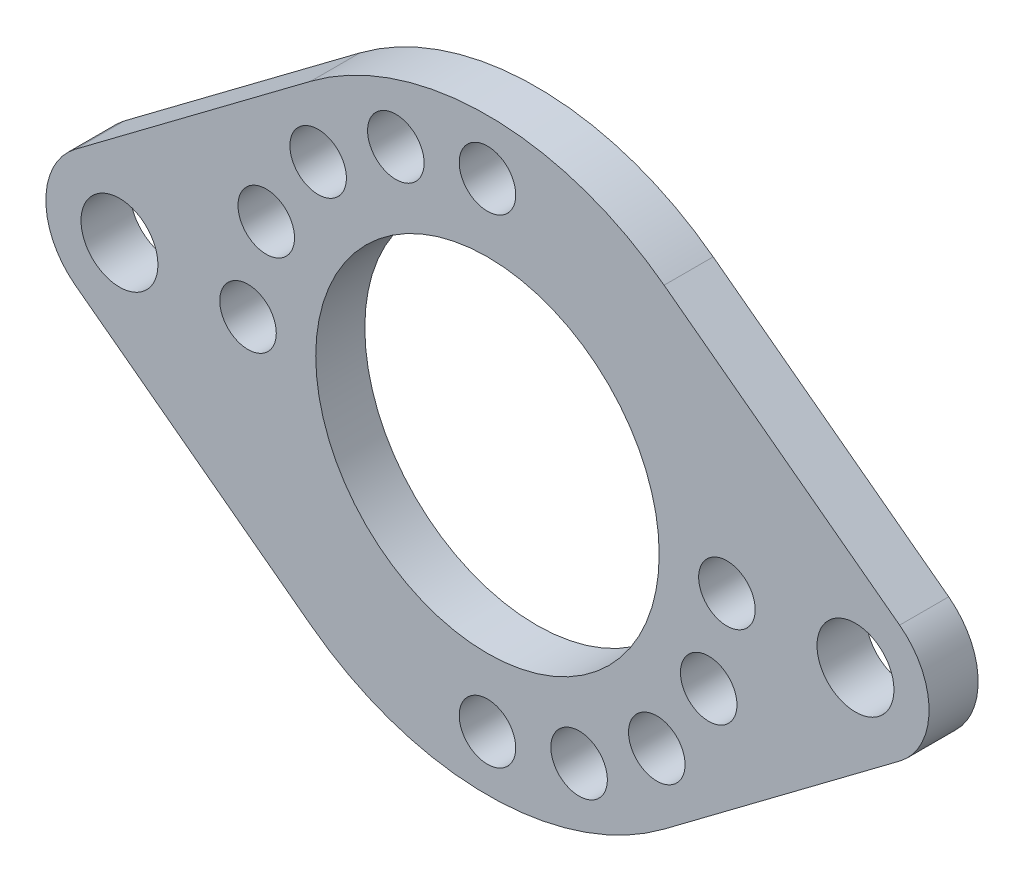
ISO-10303-21;
HEADER;
FILE_DESCRIPTION(('STEP AP214'),'2;1');
FILE_NAME('part.step','',(''),(''),'','','');
FILE_SCHEMA(('AUTOMOTIVE_DESIGN { 1 0 10303 214 1 1 1 1 }'));
ENDSEC;
DATA;
#1=APPLICATION_CONTEXT('core data for automotive mechanical design processes');
#2=APPLICATION_PROTOCOL_DEFINITION('international standard','automotive_design',2000,#1);
#3=PRODUCT_CONTEXT('',#1,'mechanical');
#4=PRODUCT('Part','Part','',(#3));
#5=PRODUCT_RELATED_PRODUCT_CATEGORY('part','',(#4));
#6=PRODUCT_DEFINITION_FORMATION('','',#4);
#7=PRODUCT_DEFINITION_CONTEXT('part definition',#1,'design');
#8=PRODUCT_DEFINITION('design','',#6,#7);
#9=PRODUCT_DEFINITION_SHAPE('','',#8);
#10=(LENGTH_UNIT() NAMED_UNIT(*) SI_UNIT(.MILLI.,.METRE.));
#11=(NAMED_UNIT(*) PLANE_ANGLE_UNIT() SI_UNIT($,.RADIAN.));
#12=(NAMED_UNIT(*) SI_UNIT($,.STERADIAN.) SOLID_ANGLE_UNIT());
#13=UNCERTAINTY_MEASURE_WITH_UNIT(LENGTH_MEASURE(1.E-05),#10,'distance_accuracy_value','');
#14=(GEOMETRIC_REPRESENTATION_CONTEXT(3) GLOBAL_UNCERTAINTY_ASSIGNED_CONTEXT((#13)) GLOBAL_UNIT_ASSIGNED_CONTEXT((#10,
#11,#12)) REPRESENTATION_CONTEXT('',''));
#15=CARTESIAN_POINT('',(0.,0.,0.));
#16=DIRECTION('',(0.,0.,1.));
#17=DIRECTION('',(1.,0.,0.));
#18=AXIS2_PLACEMENT_3D('',#15,#16,#17);
#19=CARTESIAN_POINT('',(0.,0.,-1.5875));
#20=DIRECTION('',(0.,0.,1.));
#21=DIRECTION('',(1.,0.,0.));
#22=AXIS2_PLACEMENT_3D('',#19,#20,#21);
#23=PLANE('',#22);
#24=CARTESIAN_POINT('',(0.,0.,-1.5875));
#25=DIRECTION('',(0.,0.,-1.));
#26=DIRECTION('',(-1.,0.,0.));
#27=AXIS2_PLACEMENT_3D('',#24,#25,#26);
#28=CIRCLE('',#27,11.1125);
#29=CARTESIAN_POINT('',(-11.1125,0.,-1.5875));
#30=VERTEX_POINT('',#29);
#31=EDGE_CURVE('E169',#30,#30,#28,.F.);
#32=ORIENTED_EDGE('',*,*,#31,.T.);
#33=EDGE_LOOP('',(#32));
#34=FACE_BOUND('',#33,.T.);
#35=CARTESIAN_POINT('',(-23.8125,0.,-1.5875));
#36=DIRECTION('',(0.,0.,-1.));
#37=DIRECTION('',(-1.,0.,0.));
#38=AXIS2_PLACEMENT_3D('',#35,#36,#37);
#39=CIRCLE('',#38,4.7625);
#40=CARTESIAN_POINT('',(-26.67,3.81,-1.5875));
#41=VERTEX_POINT('',#40);
#42=CARTESIAN_POINT('',(-26.67,-3.81,-1.5875));
#43=VERTEX_POINT('',#42);
#44=EDGE_CURVE('E173',#41,#43,#39,.F.);
#45=ORIENTED_EDGE('',*,*,#44,.F.);
#46=DIRECTION('',(-0.8,-0.6,0.));
#47=VECTOR('',#46,1.);
#48=CARTESIAN_POINT('',(-11.43,15.24,-1.5875));
#49=LINE('',#48,#47);
#50=CARTESIAN_POINT('',(-11.43,15.24,-1.5875));
#51=VERTEX_POINT('',#50);
#52=EDGE_CURVE('E112',#51,#41,#49,.T.);
#53=ORIENTED_EDGE('',*,*,#52,.F.);
#54=CARTESIAN_POINT('',(0.,0.,-1.5875));
#55=DIRECTION('',(0.,0.,-1.));
#56=DIRECTION('',(-1.,0.,0.));
#57=AXIS2_PLACEMENT_3D('',#54,#55,#56);
#58=CIRCLE('',#57,19.05);
#59=CARTESIAN_POINT('',(11.43,15.24,-1.5875));
#60=VERTEX_POINT('',#59);
#61=EDGE_CURVE('E117',#60,#51,#58,.F.);
#62=ORIENTED_EDGE('',*,*,#61,.F.);
#63=DIRECTION('',(0.8,-0.6,0.));
#64=VECTOR('',#63,1.);
#65=CARTESIAN_POINT('',(11.43,15.24,-1.5875));
#66=LINE('',#65,#64);
#67=CARTESIAN_POINT('',(26.67,3.81,-1.5875));
#68=VERTEX_POINT('',#67);
#69=EDGE_CURVE('E116',#60,#68,#66,.T.);
#70=ORIENTED_EDGE('',*,*,#69,.T.);
#71=CARTESIAN_POINT('',(23.8125,0.,-1.5875));
#72=DIRECTION('',(0.,0.,-1.));
#73=DIRECTION('',(-1.,0.,0.));
#74=AXIS2_PLACEMENT_3D('',#71,#72,#73);
#75=CIRCLE('',#74,4.7625);
#76=CARTESIAN_POINT('',(26.67,-3.81,-1.5875));
#77=VERTEX_POINT('',#76);
#78=EDGE_CURVE('E96',#77,#68,#75,.F.);
#79=ORIENTED_EDGE('',*,*,#78,.F.);
#80=DIRECTION('',(-0.8,-0.6,0.));
#81=VECTOR('',#80,1.);
#82=CARTESIAN_POINT('',(11.43,-15.24,-1.5875));
#83=LINE('',#82,#81);
#84=CARTESIAN_POINT('',(11.43,-15.24,-1.5875));
#85=VERTEX_POINT('',#84);
#86=EDGE_CURVE('E93',#77,#85,#83,.T.);
#87=ORIENTED_EDGE('',*,*,#86,.T.);
#88=CARTESIAN_POINT('',(0.,0.,-1.5875));
#89=DIRECTION('',(0.,0.,-1.));
#90=DIRECTION('',(-1.,0.,0.));
#91=AXIS2_PLACEMENT_3D('',#88,#89,#90);
#92=CIRCLE('',#91,19.05);
#93=CARTESIAN_POINT('',(-11.43,-15.24,-1.5875));
#94=VERTEX_POINT('',#93);
#95=EDGE_CURVE('E80',#94,#85,#92,.F.);
#96=ORIENTED_EDGE('',*,*,#95,.F.);
#97=DIRECTION('',(-0.8,0.6,0.));
#98=VECTOR('',#97,1.);
#99=CARTESIAN_POINT('',(-11.43,-15.24,-1.5875));
#100=LINE('',#99,#98);
#101=EDGE_CURVE('E90',#94,#43,#100,.T.);
#102=ORIENTED_EDGE('',*,*,#101,.T.);
#103=EDGE_LOOP('',(#45,#53,#62,#70,#79,#87,#96,#102));
#104=FACE_BOUND('',#103,.T.);
#105=CARTESIAN_POINT('',(0.,15.494,-1.5875));
#106=DIRECTION('',(0.,0.,1.));
#107=DIRECTION('',(1.,0.,0.));
#108=AXIS2_PLACEMENT_3D('',#105,#106,#107);
#109=CIRCLE('',#108,1.82879999999999);
#110=CARTESIAN_POINT('',(1.82879999999999,15.494,-1.5875));
#111=VERTEX_POINT('',#110);
#112=EDGE_CURVE('E111',#111,#111,#109,.T.);
#113=ORIENTED_EDGE('',*,*,#112,.T.);
#114=EDGE_LOOP('',(#113));
#115=FACE_BOUND('',#114,.T.);
#116=CARTESIAN_POINT('',(-15.494,0.,-1.5875));
#117=DIRECTION('',(0.,0.,1.));
#118=DIRECTION('',(1.,0.,0.));
#119=AXIS2_PLACEMENT_3D('',#116,#117,#118);
#120=CIRCLE('',#119,1.82879999999999);
#121=CARTESIAN_POINT('',(-13.6652,0.,-1.5875));
#122=VERTEX_POINT('',#121);
#123=EDGE_CURVE('E181',#122,#122,#120,.T.);
#124=ORIENTED_EDGE('',*,*,#123,.T.);
#125=EDGE_LOOP('',(#124));
#126=FACE_BOUND('',#125,.T.);
#127=CARTESIAN_POINT('',(-14.3145894767299,5.92929710106476,-1.5875));
#128=DIRECTION('',(0.,0.,1.));
#129=DIRECTION('',(1.,0.,0.));
#130=AXIS2_PLACEMENT_3D('',#127,#128,#129);
#131=CIRCLE('',#130,1.82879999999999);
#132=CARTESIAN_POINT('',(-12.4857894767299,5.92929710106476,-1.5875));
#133=VERTEX_POINT('',#132);
#134=EDGE_CURVE('E184',#133,#133,#131,.T.);
#135=ORIENTED_EDGE('',*,*,#134,.T.);
#136=EDGE_LOOP('',(#135));
#137=FACE_BOUND('',#136,.T.);
#138=CARTESIAN_POINT('',(-5.92929710106471,14.3145894767299,-1.5875));
#139=DIRECTION('',(0.,0.,1.));
#140=DIRECTION('',(1.,0.,0.));
#141=AXIS2_PLACEMENT_3D('',#138,#139,#140);
#142=CIRCLE('',#141,1.82879999999999);
#143=CARTESIAN_POINT('',(-4.10049710106472,14.3145894767299,-1.5875));
#144=VERTEX_POINT('',#143);
#145=EDGE_CURVE('E187',#144,#144,#142,.T.);
#146=ORIENTED_EDGE('',*,*,#145,.T.);
#147=EDGE_LOOP('',(#146));
#148=FACE_BOUND('',#147,.T.);
#149=CARTESIAN_POINT('',(-10.9559124677044,10.9559124677043,-1.5875));
#150=DIRECTION('',(0.,0.,1.));
#151=DIRECTION('',(1.,0.,0.));
#152=AXIS2_PLACEMENT_3D('',#149,#150,#151);
#153=CIRCLE('',#152,1.82879999999999);
#154=CARTESIAN_POINT('',(-9.1271124677044,10.9559124677043,-1.5875));
#155=VERTEX_POINT('',#154);
#156=EDGE_CURVE('E190',#155,#155,#153,.T.);
#157=ORIENTED_EDGE('',*,*,#156,.T.);
#158=EDGE_LOOP('',(#157));
#159=FACE_BOUND('',#158,.T.);
#160=CARTESIAN_POINT('',(0.,-15.494,-1.5875));
#161=DIRECTION('',(0.,0.,1.));
#162=DIRECTION('',(1.,0.,0.));
#163=AXIS2_PLACEMENT_3D('',#160,#161,#162);
#164=CIRCLE('',#163,1.82879999999999);
#165=CARTESIAN_POINT('',(1.82879999999999,-15.494,-1.5875));
#166=VERTEX_POINT('',#165);
#167=EDGE_CURVE('E193',#166,#166,#164,.T.);
#168=ORIENTED_EDGE('',*,*,#167,.T.);
#169=EDGE_LOOP('',(#168));
#170=FACE_BOUND('',#169,.T.);
#171=CARTESIAN_POINT('',(15.494,0.,-1.5875));
#172=DIRECTION('',(0.,0.,1.));
#173=DIRECTION('',(1.,0.,0.));
#174=AXIS2_PLACEMENT_3D('',#171,#172,#173);
#175=CIRCLE('',#174,1.82879999999999);
#176=CARTESIAN_POINT('',(17.3228,0.,-1.5875));
#177=VERTEX_POINT('',#176);
#178=EDGE_CURVE('E196',#177,#177,#175,.T.);
#179=ORIENTED_EDGE('',*,*,#178,.T.);
#180=EDGE_LOOP('',(#179));
#181=FACE_BOUND('',#180,.T.);
#182=CARTESIAN_POINT('',(14.3145894767299,-5.92929710106476,-1.5875));
#183=DIRECTION('',(0.,0.,1.));
#184=DIRECTION('',(1.,0.,0.));
#185=AXIS2_PLACEMENT_3D('',#182,#183,#184);
#186=CIRCLE('',#185,1.82879999999999);
#187=CARTESIAN_POINT('',(16.1433894767298,-5.92929710106476,-1.5875));
#188=VERTEX_POINT('',#187);
#189=EDGE_CURVE('E199',#188,#188,#186,.T.);
#190=ORIENTED_EDGE('',*,*,#189,.T.);
#191=EDGE_LOOP('',(#190));
#192=FACE_BOUND('',#191,.T.);
#193=CARTESIAN_POINT('',(5.92929710106471,-14.3145894767299,-1.5875));
#194=DIRECTION('',(0.,0.,1.));
#195=DIRECTION('',(1.,0.,0.));
#196=AXIS2_PLACEMENT_3D('',#193,#194,#195);
#197=CIRCLE('',#196,1.82879999999999);
#198=CARTESIAN_POINT('',(7.7580971010647,-14.3145894767299,-1.5875));
#199=VERTEX_POINT('',#198);
#200=EDGE_CURVE('E202',#199,#199,#197,.T.);
#201=ORIENTED_EDGE('',*,*,#200,.T.);
#202=EDGE_LOOP('',(#201));
#203=FACE_BOUND('',#202,.T.);
#204=CARTESIAN_POINT('',(10.9559124677044,-10.9559124677043,-1.5875));
#205=DIRECTION('',(0.,0.,1.));
#206=DIRECTION('',(1.,0.,0.));
#207=AXIS2_PLACEMENT_3D('',#204,#205,#206);
#208=CIRCLE('',#207,1.82879999999999);
#209=CARTESIAN_POINT('',(12.7847124677044,-10.9559124677043,-1.5875));
#210=VERTEX_POINT('',#209);
#211=EDGE_CURVE('E205',#210,#210,#208,.T.);
#212=ORIENTED_EDGE('',*,*,#211,.T.);
#213=EDGE_LOOP('',(#212));
#214=FACE_BOUND('',#213,.T.);
#215=CARTESIAN_POINT('',(-23.8125,0.,-1.5875));
#216=DIRECTION('',(0.,0.,1.));
#217=DIRECTION('',(1.,0.,0.));
#218=AXIS2_PLACEMENT_3D('',#215,#216,#217);
#219=CIRCLE('',#218,2.48919999999999);
#220=CARTESIAN_POINT('',(-21.3233,0.,-1.5875));
#221=VERTEX_POINT('',#220);
#222=EDGE_CURVE('E207',#221,#221,#219,.T.);
#223=ORIENTED_EDGE('',*,*,#222,.T.);
#224=EDGE_LOOP('',(#223));
#225=FACE_BOUND('',#224,.T.);
#226=CARTESIAN_POINT('',(23.8125,0.,-1.5875));
#227=DIRECTION('',(0.,0.,1.));
#228=DIRECTION('',(1.,0.,0.));
#229=AXIS2_PLACEMENT_3D('',#226,#227,#228);
#230=CIRCLE('',#229,2.48919999999999);
#231=CARTESIAN_POINT('',(26.3017,0.,-1.5875));
#232=VERTEX_POINT('',#231);
#233=EDGE_CURVE('E21',#232,#232,#230,.T.);
#234=ORIENTED_EDGE('',*,*,#233,.T.);
#235=EDGE_LOOP('',(#234));
#236=FACE_BOUND('',#235,.T.);
#237=ADVANCED_FACE('F18',(#34,#104,#115,#126,#137,#148,#159,#170,#181,#192,#203,#214,#225,#236),
#23,.F.);
#238=CARTESIAN_POINT('',(23.8125,0.,1.5875));
#239=DIRECTION('',(0.,0.,1.));
#240=DIRECTION('',(1.,0.,0.));
#241=AXIS2_PLACEMENT_3D('',#238,#239,#240);
#242=CYLINDRICAL_SURFACE('',#241,2.48919999999999);
#243=CARTESIAN_POINT('',(23.8125,0.,1.5875));
#244=DIRECTION('',(0.,0.,1.));
#245=DIRECTION('',(1.,0.,0.));
#246=AXIS2_PLACEMENT_3D('',#243,#244,#245);
#247=CIRCLE('',#246,2.48919999999999);
#248=CARTESIAN_POINT('',(26.3017,0.,1.5875));
#249=VERTEX_POINT('',#248);
#250=EDGE_CURVE('E166',#249,#249,#247,.F.);
#251=ORIENTED_EDGE('',*,*,#250,.F.);
#252=EDGE_LOOP('',(#251));
#253=FACE_BOUND('',#252,.T.);
#254=ORIENTED_EDGE('',*,*,#233,.F.);
#255=EDGE_LOOP('',(#254));
#256=FACE_BOUND('',#255,.T.);
#257=ADVANCED_FACE('F215',(#253,#256),#242,.F.);
#258=CARTESIAN_POINT('',(-23.8125,0.,1.5875));
#259=DIRECTION('',(0.,0.,1.));
#260=DIRECTION('',(1.,0.,0.));
#261=AXIS2_PLACEMENT_3D('',#258,#259,#260);
#262=CYLINDRICAL_SURFACE('',#261,2.48919999999999);
#263=CARTESIAN_POINT('',(-23.8125,0.,1.5875));
#264=DIRECTION('',(0.,0.,1.));
#265=DIRECTION('',(1.,0.,0.));
#266=AXIS2_PLACEMENT_3D('',#263,#264,#265);
#267=CIRCLE('',#266,2.48919999999999);
#268=CARTESIAN_POINT('',(-21.3233,0.,1.5875));
#269=VERTEX_POINT('',#268);
#270=EDGE_CURVE('E163',#269,#269,#267,.F.);
#271=ORIENTED_EDGE('',*,*,#270,.F.);
#272=EDGE_LOOP('',(#271));
#273=FACE_BOUND('',#272,.T.);
#274=ORIENTED_EDGE('',*,*,#222,.F.);
#275=EDGE_LOOP('',(#274));
#276=FACE_BOUND('',#275,.T.);
#277=ADVANCED_FACE('F217',(#273,#276),#262,.F.);
#278=CARTESIAN_POINT('',(10.9559124677044,-10.9559124677043,1.5875));
#279=DIRECTION('',(0.,0.,1.));
#280=DIRECTION('',(1.,0.,0.));
#281=AXIS2_PLACEMENT_3D('',#278,#279,#280);
#282=CYLINDRICAL_SURFACE('',#281,1.82879999999999);
#283=CARTESIAN_POINT('',(10.9559124677044,-10.9559124677043,1.5875));
#284=DIRECTION('',(0.,0.,1.));
#285=DIRECTION('',(1.,0.,0.));
#286=AXIS2_PLACEMENT_3D('',#283,#284,#285);
#287=CIRCLE('',#286,1.82879999999999);
#288=CARTESIAN_POINT('',(12.7847124677044,-10.9559124677043,1.5875));
#289=VERTEX_POINT('',#288);
#290=EDGE_CURVE('E160',#289,#289,#287,.F.);
#291=ORIENTED_EDGE('',*,*,#290,.F.);
#292=EDGE_LOOP('',(#291));
#293=FACE_BOUND('',#292,.T.);
#294=ORIENTED_EDGE('',*,*,#211,.F.);
#295=EDGE_LOOP('',(#294));
#296=FACE_BOUND('',#295,.T.);
#297=ADVANCED_FACE('F224',(#293,#296),#282,.F.);
#298=CARTESIAN_POINT('',(5.92929710106471,-14.3145894767299,1.5875));
#299=DIRECTION('',(0.,0.,1.));
#300=DIRECTION('',(1.,0.,0.));
#301=AXIS2_PLACEMENT_3D('',#298,#299,#300);
#302=CYLINDRICAL_SURFACE('',#301,1.82879999999999);
#303=CARTESIAN_POINT('',(5.92929710106471,-14.3145894767299,1.5875));
#304=DIRECTION('',(0.,0.,1.));
#305=DIRECTION('',(1.,0.,0.));
#306=AXIS2_PLACEMENT_3D('',#303,#304,#305);
#307=CIRCLE('',#306,1.82879999999999);
#308=CARTESIAN_POINT('',(7.7580971010647,-14.3145894767299,1.5875));
#309=VERTEX_POINT('',#308);
#310=EDGE_CURVE('E157',#309,#309,#307,.F.);
#311=ORIENTED_EDGE('',*,*,#310,.F.);
#312=EDGE_LOOP('',(#311));
#313=FACE_BOUND('',#312,.T.);
#314=ORIENTED_EDGE('',*,*,#200,.F.);
#315=EDGE_LOOP('',(#314));
#316=FACE_BOUND('',#315,.T.);
#317=ADVANCED_FACE('F299',(#313,#316),#302,.F.);
#318=CARTESIAN_POINT('',(14.3145894767299,-5.92929710106476,1.5875));
#319=DIRECTION('',(0.,0.,1.));
#320=DIRECTION('',(1.,0.,0.));
#321=AXIS2_PLACEMENT_3D('',#318,#319,#320);
#322=CYLINDRICAL_SURFACE('',#321,1.82879999999999);
#323=CARTESIAN_POINT('',(14.3145894767299,-5.92929710106476,1.5875));
#324=DIRECTION('',(0.,0.,1.));
#325=DIRECTION('',(1.,0.,0.));
#326=AXIS2_PLACEMENT_3D('',#323,#324,#325);
#327=CIRCLE('',#326,1.82879999999999);
#328=CARTESIAN_POINT('',(16.1433894767298,-5.92929710106476,1.5875));
#329=VERTEX_POINT('',#328);
#330=EDGE_CURVE('E154',#329,#329,#327,.F.);
#331=ORIENTED_EDGE('',*,*,#330,.F.);
#332=EDGE_LOOP('',(#331));
#333=FACE_BOUND('',#332,.T.);
#334=ORIENTED_EDGE('',*,*,#189,.F.);
#335=EDGE_LOOP('',(#334));
#336=FACE_BOUND('',#335,.T.);
#337=ADVANCED_FACE('F295',(#333,#336),#322,.F.);
#338=CARTESIAN_POINT('',(15.494,0.,1.5875));
#339=DIRECTION('',(0.,0.,1.));
#340=DIRECTION('',(1.,0.,0.));
#341=AXIS2_PLACEMENT_3D('',#338,#339,#340);
#342=CYLINDRICAL_SURFACE('',#341,1.82879999999999);
#343=CARTESIAN_POINT('',(15.494,0.,1.5875));
#344=DIRECTION('',(0.,0.,1.));
#345=DIRECTION('',(1.,0.,0.));
#346=AXIS2_PLACEMENT_3D('',#343,#344,#345);
#347=CIRCLE('',#346,1.82879999999999);
#348=CARTESIAN_POINT('',(17.3228,0.,1.5875));
#349=VERTEX_POINT('',#348);
#350=EDGE_CURVE('E151',#349,#349,#347,.F.);
#351=ORIENTED_EDGE('',*,*,#350,.F.);
#352=EDGE_LOOP('',(#351));
#353=FACE_BOUND('',#352,.T.);
#354=ORIENTED_EDGE('',*,*,#178,.F.);
#355=EDGE_LOOP('',(#354));
#356=FACE_BOUND('',#355,.T.);
#357=ADVANCED_FACE('F291',(#353,#356),#342,.F.);
#358=CARTESIAN_POINT('',(0.,-15.494,1.5875));
#359=DIRECTION('',(0.,0.,1.));
#360=DIRECTION('',(1.,0.,0.));
#361=AXIS2_PLACEMENT_3D('',#358,#359,#360);
#362=CYLINDRICAL_SURFACE('',#361,1.82879999999999);
#363=CARTESIAN_POINT('',(0.,-15.494,1.5875));
#364=DIRECTION('',(0.,0.,1.));
#365=DIRECTION('',(1.,0.,0.));
#366=AXIS2_PLACEMENT_3D('',#363,#364,#365);
#367=CIRCLE('',#366,1.82879999999999);
#368=CARTESIAN_POINT('',(1.82879999999999,-15.494,1.5875));
#369=VERTEX_POINT('',#368);
#370=EDGE_CURVE('E148',#369,#369,#367,.F.);
#371=ORIENTED_EDGE('',*,*,#370,.F.);
#372=EDGE_LOOP('',(#371));
#373=FACE_BOUND('',#372,.T.);
#374=ORIENTED_EDGE('',*,*,#167,.F.);
#375=EDGE_LOOP('',(#374));
#376=FACE_BOUND('',#375,.T.);
#377=ADVANCED_FACE('F287',(#373,#376),#362,.F.);
#378=CARTESIAN_POINT('',(-10.9559124677044,10.9559124677043,1.5875));
#379=DIRECTION('',(0.,0.,1.));
#380=DIRECTION('',(1.,0.,0.));
#381=AXIS2_PLACEMENT_3D('',#378,#379,#380);
#382=CYLINDRICAL_SURFACE('',#381,1.82879999999999);
#383=CARTESIAN_POINT('',(-10.9559124677044,10.9559124677043,1.5875));
#384=DIRECTION('',(0.,0.,1.));
#385=DIRECTION('',(1.,0.,0.));
#386=AXIS2_PLACEMENT_3D('',#383,#384,#385);
#387=CIRCLE('',#386,1.82879999999999);
#388=CARTESIAN_POINT('',(-9.1271124677044,10.9559124677043,1.5875));
#389=VERTEX_POINT('',#388);
#390=EDGE_CURVE('E145',#389,#389,#387,.F.);
#391=ORIENTED_EDGE('',*,*,#390,.F.);
#392=EDGE_LOOP('',(#391));
#393=FACE_BOUND('',#392,.T.);
#394=ORIENTED_EDGE('',*,*,#156,.F.);
#395=EDGE_LOOP('',(#394));
#396=FACE_BOUND('',#395,.T.);
#397=ADVANCED_FACE('F283',(#393,#396),#382,.F.);
#398=CARTESIAN_POINT('',(-5.92929710106471,14.3145894767299,1.5875));
#399=DIRECTION('',(0.,0.,1.));
#400=DIRECTION('',(1.,0.,0.));
#401=AXIS2_PLACEMENT_3D('',#398,#399,#400);
#402=CYLINDRICAL_SURFACE('',#401,1.82879999999999);
#403=CARTESIAN_POINT('',(-5.92929710106471,14.3145894767299,1.5875));
#404=DIRECTION('',(0.,0.,1.));
#405=DIRECTION('',(1.,0.,0.));
#406=AXIS2_PLACEMENT_3D('',#403,#404,#405);
#407=CIRCLE('',#406,1.82879999999999);
#408=CARTESIAN_POINT('',(-4.10049710106472,14.3145894767299,1.5875));
#409=VERTEX_POINT('',#408);
#410=EDGE_CURVE('E142',#409,#409,#407,.F.);
#411=ORIENTED_EDGE('',*,*,#410,.F.);
#412=EDGE_LOOP('',(#411));
#413=FACE_BOUND('',#412,.T.);
#414=ORIENTED_EDGE('',*,*,#145,.F.);
#415=EDGE_LOOP('',(#414));
#416=FACE_BOUND('',#415,.T.);
#417=ADVANCED_FACE('F279',(#413,#416),#402,.F.);
#418=CARTESIAN_POINT('',(-14.3145894767299,5.92929710106476,1.5875));
#419=DIRECTION('',(0.,0.,1.));
#420=DIRECTION('',(1.,0.,0.));
#421=AXIS2_PLACEMENT_3D('',#418,#419,#420);
#422=CYLINDRICAL_SURFACE('',#421,1.82879999999999);
#423=CARTESIAN_POINT('',(-14.3145894767299,5.92929710106476,1.5875));
#424=DIRECTION('',(0.,0.,1.));
#425=DIRECTION('',(1.,0.,0.));
#426=AXIS2_PLACEMENT_3D('',#423,#424,#425);
#427=CIRCLE('',#426,1.82879999999999);
#428=CARTESIAN_POINT('',(-12.4857894767299,5.92929710106476,1.5875));
#429=VERTEX_POINT('',#428);
#430=EDGE_CURVE('E139',#429,#429,#427,.F.);
#431=ORIENTED_EDGE('',*,*,#430,.F.);
#432=EDGE_LOOP('',(#431));
#433=FACE_BOUND('',#432,.T.);
#434=ORIENTED_EDGE('',*,*,#134,.F.);
#435=EDGE_LOOP('',(#434));
#436=FACE_BOUND('',#435,.T.);
#437=ADVANCED_FACE('F275',(#433,#436),#422,.F.);
#438=CARTESIAN_POINT('',(-15.494,0.,1.5875));
#439=DIRECTION('',(0.,0.,1.));
#440=DIRECTION('',(1.,0.,0.));
#441=AXIS2_PLACEMENT_3D('',#438,#439,#440);
#442=CYLINDRICAL_SURFACE('',#441,1.82879999999999);
#443=CARTESIAN_POINT('',(-15.494,0.,1.5875));
#444=DIRECTION('',(0.,0.,1.));
#445=DIRECTION('',(1.,0.,0.));
#446=AXIS2_PLACEMENT_3D('',#443,#444,#445);
#447=CIRCLE('',#446,1.82879999999999);
#448=CARTESIAN_POINT('',(-13.6652,0.,1.5875));
#449=VERTEX_POINT('',#448);
#450=EDGE_CURVE('E136',#449,#449,#447,.F.);
#451=ORIENTED_EDGE('',*,*,#450,.F.);
#452=EDGE_LOOP('',(#451));
#453=FACE_BOUND('',#452,.T.);
#454=ORIENTED_EDGE('',*,*,#123,.F.);
#455=EDGE_LOOP('',(#454));
#456=FACE_BOUND('',#455,.T.);
#457=ADVANCED_FACE('F271',(#453,#456),#442,.F.);
#458=CARTESIAN_POINT('',(0.,15.494,1.5875));
#459=DIRECTION('',(0.,0.,1.));
#460=DIRECTION('',(1.,0.,0.));
#461=AXIS2_PLACEMENT_3D('',#458,#459,#460);
#462=CYLINDRICAL_SURFACE('',#461,1.82879999999999);
#463=CARTESIAN_POINT('',(0.,15.494,1.5875));
#464=DIRECTION('',(0.,0.,1.));
#465=DIRECTION('',(1.,0.,0.));
#466=AXIS2_PLACEMENT_3D('',#463,#464,#465);
#467=CIRCLE('',#466,1.82879999999999);
#468=CARTESIAN_POINT('',(1.82879999999999,15.494,1.5875));
#469=VERTEX_POINT('',#468);
#470=EDGE_CURVE('E133',#469,#469,#467,.F.);
#471=ORIENTED_EDGE('',*,*,#470,.F.);
#472=EDGE_LOOP('',(#471));
#473=FACE_BOUND('',#472,.T.);
#474=ORIENTED_EDGE('',*,*,#112,.F.);
#475=EDGE_LOOP('',(#474));
#476=FACE_BOUND('',#475,.T.);
#477=ADVANCED_FACE('F267',(#473,#476),#462,.F.);
#478=CARTESIAN_POINT('',(-11.43,-15.24,1.5875));
#479=DIRECTION('',(0.6,0.8,0.));
#480=DIRECTION('',(-0.8,0.6,0.));
#481=AXIS2_PLACEMENT_3D('',#478,#479,#480);
#482=PLANE('',#481);
#483=DIRECTION('',(0.,0.,-1.));
#484=VECTOR('',#483,1.);
#485=CARTESIAN_POINT('',(-11.43,-15.24,1.5875));
#486=LINE('',#485,#484);
#487=CARTESIAN_POINT('',(-11.43,-15.24,1.5875));
#488=VERTEX_POINT('',#487);
#489=EDGE_CURVE('E89',#488,#94,#486,.T.);
#490=ORIENTED_EDGE('',*,*,#489,.F.);
#491=DIRECTION('',(0.8,-0.6,0.));
#492=VECTOR('',#491,1.);
#493=CARTESIAN_POINT('',(-26.67,-3.81,1.5875));
#494=LINE('',#493,#492);
#495=CARTESIAN_POINT('',(-26.67,-3.81,1.5875));
#496=VERTEX_POINT('',#495);
#497=EDGE_CURVE('E132',#496,#488,#494,.T.);
#498=ORIENTED_EDGE('',*,*,#497,.F.);
#499=DIRECTION('',(0.,0.,-1.));
#500=VECTOR('',#499,1.);
#501=CARTESIAN_POINT('',(-26.67,-3.81,1.5875));
#502=LINE('',#501,#500);
#503=EDGE_CURVE('E172',#43,#496,#502,.F.);
#504=ORIENTED_EDGE('',*,*,#503,.F.);
#505=ORIENTED_EDGE('',*,*,#101,.F.);
#506=EDGE_LOOP('',(#490,#498,#504,#505));
#507=FACE_BOUND('',#506,.T.);
#508=ADVANCED_FACE('F264',(#507),#482,.F.);
#509=CARTESIAN_POINT('',(0.,0.,1.5875));
#510=DIRECTION('',(0.,0.,-1.));
#511=DIRECTION('',(-1.,0.,0.));
#512=AXIS2_PLACEMENT_3D('',#509,#510,#511);
#513=CYLINDRICAL_SURFACE('',#512,19.05);
#514=CARTESIAN_POINT('',(0.,0.,1.5875));
#515=DIRECTION('',(0.,0.,-1.));
#516=DIRECTION('',(-1.,0.,0.));
#517=AXIS2_PLACEMENT_3D('',#514,#515,#516);
#518=CIRCLE('',#517,19.05);
#519=CARTESIAN_POINT('',(11.43,-15.24,1.5875));
#520=VERTEX_POINT('',#519);
#521=EDGE_CURVE('E130',#488,#520,#518,.F.);
#522=ORIENTED_EDGE('',*,*,#521,.F.);
#523=ORIENTED_EDGE('',*,*,#489,.T.);
#524=ORIENTED_EDGE('',*,*,#95,.T.);
#525=DIRECTION('',(0.,0.,1.));
#526=VECTOR('',#525,1.);
#527=CARTESIAN_POINT('',(11.43,-15.24,1.5875));
#528=LINE('',#527,#526);
#529=EDGE_CURVE('E87',#85,#520,#528,.T.);
#530=ORIENTED_EDGE('',*,*,#529,.T.);
#531=EDGE_LOOP('',(#522,#523,#524,#530));
#532=FACE_BOUND('',#531,.T.);
#533=ADVANCED_FACE('F85',(#532),#513,.T.);
#534=CARTESIAN_POINT('',(11.43,-15.24,1.5875));
#535=DIRECTION('',(-0.6,0.8,0.));
#536=DIRECTION('',(-0.8,-0.6,0.));
#537=AXIS2_PLACEMENT_3D('',#534,#535,#536);
#538=PLANE('',#537);
#539=DIRECTION('',(0.,0.,-1.));
#540=VECTOR('',#539,1.);
#541=CARTESIAN_POINT('',(26.67,-3.81,1.5875));
#542=LINE('',#541,#540);
#543=CARTESIAN_POINT('',(26.67,-3.81,1.5875));
#544=VERTEX_POINT('',#543);
#545=EDGE_CURVE('E107',#544,#77,#542,.T.);
#546=ORIENTED_EDGE('',*,*,#545,.F.);
#547=DIRECTION('',(0.8,0.6,0.));
#548=VECTOR('',#547,1.);
#549=CARTESIAN_POINT('',(11.43,-15.24,1.5875));
#550=LINE('',#549,#548);
#551=EDGE_CURVE('E102',#520,#544,#550,.T.);
#552=ORIENTED_EDGE('',*,*,#551,.F.);
#553=ORIENTED_EDGE('',*,*,#529,.F.);
#554=ORIENTED_EDGE('',*,*,#86,.F.);
#555=EDGE_LOOP('',(#546,#552,#553,#554));
#556=FACE_BOUND('',#555,.T.);
#557=ADVANCED_FACE('F100',(#556),#538,.F.);
#558=CARTESIAN_POINT('',(23.8125,0.,1.5875));
#559=DIRECTION('',(0.,0.,-1.));
#560=DIRECTION('',(-1.,0.,0.));
#561=AXIS2_PLACEMENT_3D('',#558,#559,#560);
#562=CYLINDRICAL_SURFACE('',#561,4.7625);
#563=CARTESIAN_POINT('',(23.8125,0.,1.5875));
#564=DIRECTION('',(0.,0.,-1.));
#565=DIRECTION('',(-1.,0.,0.));
#566=AXIS2_PLACEMENT_3D('',#563,#564,#565);
#567=CIRCLE('',#566,4.7625);
#568=CARTESIAN_POINT('',(26.67,3.81,1.5875));
#569=VERTEX_POINT('',#568);
#570=EDGE_CURVE('E127',#544,#569,#567,.F.);
#571=ORIENTED_EDGE('',*,*,#570,.F.);
#572=ORIENTED_EDGE('',*,*,#545,.T.);
#573=ORIENTED_EDGE('',*,*,#78,.T.);
#574=DIRECTION('',(0.,0.,1.));
#575=VECTOR('',#574,1.);
#576=CARTESIAN_POINT('',(26.67,3.81,1.5875));
#577=LINE('',#576,#575);
#578=EDGE_CURVE('E118',#68,#569,#577,.T.);
#579=ORIENTED_EDGE('',*,*,#578,.T.);
#580=EDGE_LOOP('',(#571,#572,#573,#579));
#581=FACE_BOUND('',#580,.T.);
#582=ADVANCED_FACE('F255',(#581),#562,.T.);
#583=CARTESIAN_POINT('',(11.43,15.24,1.5875));
#584=DIRECTION('',(-0.6,-0.8,0.));
#585=DIRECTION('',(0.8,-0.6,0.));
#586=AXIS2_PLACEMENT_3D('',#583,#584,#585);
#587=PLANE('',#586);
#588=DIRECTION('',(0.,0.,-1.));
#589=VECTOR('',#588,1.);
#590=CARTESIAN_POINT('',(11.43,15.24,1.5875));
#591=LINE('',#590,#589);
#592=CARTESIAN_POINT('',(11.43,15.24,1.5875));
#593=VERTEX_POINT('',#592);
#594=EDGE_CURVE('E115',#593,#60,#591,.T.);
#595=ORIENTED_EDGE('',*,*,#594,.F.);
#596=DIRECTION('',(-0.8,0.6,0.));
#597=VECTOR('',#596,1.);
#598=CARTESIAN_POINT('',(26.67,3.81,1.5875));
#599=LINE('',#598,#597);
#600=EDGE_CURVE('E126',#569,#593,#599,.T.);
#601=ORIENTED_EDGE('',*,*,#600,.F.);
#602=ORIENTED_EDGE('',*,*,#578,.F.);
#603=ORIENTED_EDGE('',*,*,#69,.F.);
#604=EDGE_LOOP('',(#595,#601,#602,#603));
#605=FACE_BOUND('',#604,.T.);
#606=ADVANCED_FACE('F251',(#605),#587,.F.);
#607=CARTESIAN_POINT('',(0.,0.,1.5875));
#608=DIRECTION('',(0.,0.,-1.));
#609=DIRECTION('',(-1.,0.,0.));
#610=AXIS2_PLACEMENT_3D('',#607,#608,#609);
#611=CYLINDRICAL_SURFACE('',#610,19.05);
#612=CARTESIAN_POINT('',(0.,0.,1.5875));
#613=DIRECTION('',(0.,0.,-1.));
#614=DIRECTION('',(-1.,0.,0.));
#615=AXIS2_PLACEMENT_3D('',#612,#613,#614);
#616=CIRCLE('',#615,19.05);
#617=CARTESIAN_POINT('',(-11.43,15.24,1.5875));
#618=VERTEX_POINT('',#617);
#619=EDGE_CURVE('E123',#593,#618,#616,.F.);
#620=ORIENTED_EDGE('',*,*,#619,.F.);
#621=ORIENTED_EDGE('',*,*,#594,.T.);
#622=ORIENTED_EDGE('',*,*,#61,.T.);
#623=DIRECTION('',(0.,0.,1.));
#624=VECTOR('',#623,1.);
#625=CARTESIAN_POINT('',(-11.43,15.24,1.5875));
#626=LINE('',#625,#624);
#627=EDGE_CURVE('E114',#618,#51,#626,.F.);
#628=ORIENTED_EDGE('',*,*,#627,.F.);
#629=EDGE_LOOP('',(#620,#621,#622,#628));
#630=FACE_BOUND('',#629,.T.);
#631=ADVANCED_FACE('F248',(#630),#611,.T.);
#632=CARTESIAN_POINT('',(-11.43,15.24,1.5875));
#633=DIRECTION('',(-0.6,0.8,0.));
#634=DIRECTION('',(-0.8,-0.6,0.));
#635=AXIS2_PLACEMENT_3D('',#632,#633,#634);
#636=PLANE('',#635);
#637=DIRECTION('',(-0.8,-0.6,0.));
#638=VECTOR('',#637,1.);
#639=CARTESIAN_POINT('',(-11.43,15.24,1.5875));
#640=LINE('',#639,#638);
#641=CARTESIAN_POINT('',(-26.67,3.81,1.5875));
#642=VERTEX_POINT('',#641);
#643=EDGE_CURVE('E122',#618,#642,#640,.T.);
#644=ORIENTED_EDGE('',*,*,#643,.F.);
#645=ORIENTED_EDGE('',*,*,#627,.T.);
#646=ORIENTED_EDGE('',*,*,#52,.T.);
#647=DIRECTION('',(0.,0.,-1.));
#648=VECTOR('',#647,1.);
#649=CARTESIAN_POINT('',(-26.67,3.81,1.5875));
#650=LINE('',#649,#648);
#651=EDGE_CURVE('E36',#642,#41,#650,.T.);
#652=ORIENTED_EDGE('',*,*,#651,.F.);
#653=EDGE_LOOP('',(#644,#645,#646,#652));
#654=FACE_BOUND('',#653,.T.);
#655=ADVANCED_FACE('F244',(#654),#636,.T.);
#656=CARTESIAN_POINT('',(-23.8125,0.,1.5875));
#657=DIRECTION('',(0.,0.,-1.));
#658=DIRECTION('',(-1.,0.,0.));
#659=AXIS2_PLACEMENT_3D('',#656,#657,#658);
#660=CYLINDRICAL_SURFACE('',#659,4.7625);
#661=ORIENTED_EDGE('',*,*,#44,.T.);
#662=ORIENTED_EDGE('',*,*,#503,.T.);
#663=CARTESIAN_POINT('',(-23.8125,0.,1.5875));
#664=DIRECTION('',(0.,0.,-1.));
#665=DIRECTION('',(-1.,0.,0.));
#666=AXIS2_PLACEMENT_3D('',#663,#664,#665);
#667=CIRCLE('',#666,4.7625);
#668=EDGE_CURVE('E27',#642,#496,#667,.F.);
#669=ORIENTED_EDGE('',*,*,#668,.F.);
#670=ORIENTED_EDGE('',*,*,#651,.T.);
#671=EDGE_LOOP('',(#661,#662,#669,#670));
#672=FACE_BOUND('',#671,.T.);
#673=ADVANCED_FACE('F237',(#672),#660,.T.);
#674=CARTESIAN_POINT('',(0.,0.,1.5875));
#675=DIRECTION('',(0.,0.,-1.));
#676=DIRECTION('',(-1.,0.,0.));
#677=AXIS2_PLACEMENT_3D('',#674,#675,#676);
#678=CYLINDRICAL_SURFACE('',#677,11.1125);
#679=CARTESIAN_POINT('',(0.,0.,1.5875));
#680=DIRECTION('',(0.,0.,-1.));
#681=DIRECTION('',(-1.,0.,0.));
#682=AXIS2_PLACEMENT_3D('',#679,#680,#681);
#683=CIRCLE('',#682,11.1125);
#684=CARTESIAN_POINT('',(-11.1125,0.,1.5875));
#685=VERTEX_POINT('',#684);
#686=EDGE_CURVE('E11',#685,#685,#683,.T.);
#687=ORIENTED_EDGE('',*,*,#686,.F.);
#688=EDGE_LOOP('',(#687));
#689=FACE_BOUND('',#688,.T.);
#690=ORIENTED_EDGE('',*,*,#31,.F.);
#691=EDGE_LOOP('',(#690));
#692=FACE_BOUND('',#691,.T.);
#693=ADVANCED_FACE('F231',(#689,#692),#678,.F.);
#694=CARTESIAN_POINT('',(0.,0.,1.5875));
#695=DIRECTION('',(0.,0.,1.));
#696=DIRECTION('',(1.,0.,0.));
#697=AXIS2_PLACEMENT_3D('',#694,#695,#696);
#698=PLANE('',#697);
#699=ORIENTED_EDGE('',*,*,#686,.T.);
#700=EDGE_LOOP('',(#699));
#701=FACE_BOUND('',#700,.T.);
#702=ORIENTED_EDGE('',*,*,#668,.T.);
#703=ORIENTED_EDGE('',*,*,#497,.T.);
#704=ORIENTED_EDGE('',*,*,#521,.T.);
#705=ORIENTED_EDGE('',*,*,#551,.T.);
#706=ORIENTED_EDGE('',*,*,#570,.T.);
#707=ORIENTED_EDGE('',*,*,#600,.T.);
#708=ORIENTED_EDGE('',*,*,#619,.T.);
#709=ORIENTED_EDGE('',*,*,#643,.T.);
#710=EDGE_LOOP('',(#702,#703,#704,#705,#706,#707,#708,#709));
#711=FACE_BOUND('',#710,.T.);
#712=ORIENTED_EDGE('',*,*,#470,.T.);
#713=EDGE_LOOP('',(#712));
#714=FACE_BOUND('',#713,.T.);
#715=ORIENTED_EDGE('',*,*,#450,.T.);
#716=EDGE_LOOP('',(#715));
#717=FACE_BOUND('',#716,.T.);
#718=ORIENTED_EDGE('',*,*,#430,.T.);
#719=EDGE_LOOP('',(#718));
#720=FACE_BOUND('',#719,.T.);
#721=ORIENTED_EDGE('',*,*,#410,.T.);
#722=EDGE_LOOP('',(#721));
#723=FACE_BOUND('',#722,.T.);
#724=ORIENTED_EDGE('',*,*,#390,.T.);
#725=EDGE_LOOP('',(#724));
#726=FACE_BOUND('',#725,.T.);
#727=ORIENTED_EDGE('',*,*,#370,.T.);
#728=EDGE_LOOP('',(#727));
#729=FACE_BOUND('',#728,.T.);
#730=ORIENTED_EDGE('',*,*,#350,.T.);
#731=EDGE_LOOP('',(#730));
#732=FACE_BOUND('',#731,.T.);
#733=ORIENTED_EDGE('',*,*,#330,.T.);
#734=EDGE_LOOP('',(#733));
#735=FACE_BOUND('',#734,.T.);
#736=ORIENTED_EDGE('',*,*,#310,.T.);
#737=EDGE_LOOP('',(#736));
#738=FACE_BOUND('',#737,.T.);
#739=ORIENTED_EDGE('',*,*,#290,.T.);
#740=EDGE_LOOP('',(#739));
#741=FACE_BOUND('',#740,.T.);
#742=ORIENTED_EDGE('',*,*,#270,.T.);
#743=EDGE_LOOP('',(#742));
#744=FACE_BOUND('',#743,.T.);
#745=ORIENTED_EDGE('',*,*,#250,.T.);
#746=EDGE_LOOP('',(#745));
#747=FACE_BOUND('',#746,.T.);
#748=ADVANCED_FACE('F229',(#701,#711,#714,#717,#720,#723,#726,#729,#732,#735,#738,#741,#744,
#747),#698,.T.);
#749=CLOSED_SHELL('',(#237,#257,#277,#297,#317,#337,#357,#377,#397,#417,#437,#457,#477,#508,
#533,#557,#582,#606,#631,#655,#673,#693,#748));
#750=MANIFOLD_SOLID_BREP('B1',#749);
#751=ADVANCED_BREP_SHAPE_REPRESENTATION('',(#18,#750),#14);
#752=SHAPE_DEFINITION_REPRESENTATION(#9,#751);
ENDSEC;
END-ISO-10303-21;
